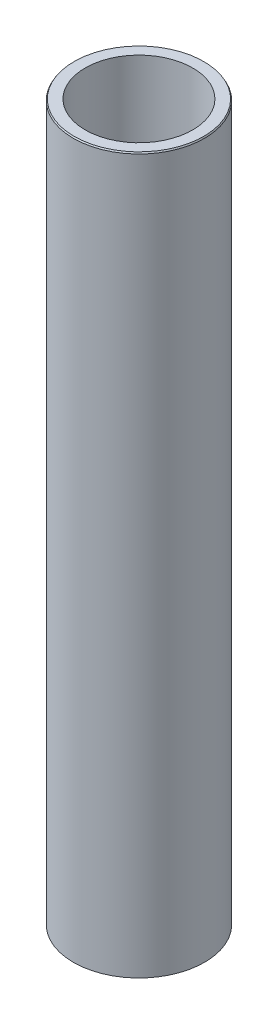
ISO-10303-21;
HEADER;
FILE_DESCRIPTION(('STEP AP214'),'2;1');
FILE_NAME('part.step','',(''),(''),'','','');
FILE_SCHEMA(('AUTOMOTIVE_DESIGN { 1 0 10303 214 1 1 1 1 }'));
ENDSEC;
DATA;
#1=APPLICATION_CONTEXT('core data for automotive mechanical design processes');
#2=APPLICATION_PROTOCOL_DEFINITION('international standard','automotive_design',2000,#1);
#3=PRODUCT_CONTEXT('',#1,'mechanical');
#4=PRODUCT('Part','Part','',(#3));
#5=PRODUCT_RELATED_PRODUCT_CATEGORY('part','',(#4));
#6=PRODUCT_DEFINITION_FORMATION('','',#4);
#7=PRODUCT_DEFINITION_CONTEXT('part definition',#1,'design');
#8=PRODUCT_DEFINITION('design','',#6,#7);
#9=PRODUCT_DEFINITION_SHAPE('','',#8);
#10=(LENGTH_UNIT() NAMED_UNIT(*) SI_UNIT(.MILLI.,.METRE.));
#11=(NAMED_UNIT(*) PLANE_ANGLE_UNIT() SI_UNIT($,.RADIAN.));
#12=(NAMED_UNIT(*) SI_UNIT($,.STERADIAN.) SOLID_ANGLE_UNIT());
#13=UNCERTAINTY_MEASURE_WITH_UNIT(LENGTH_MEASURE(1.E-05),#10,'distance_accuracy_value','');
#14=(GEOMETRIC_REPRESENTATION_CONTEXT(3) GLOBAL_UNCERTAINTY_ASSIGNED_CONTEXT((#13)) GLOBAL_UNIT_ASSIGNED_CONTEXT((#10,
#11,#12)) REPRESENTATION_CONTEXT('',''));
#15=CARTESIAN_POINT('',(0.,0.,0.));
#16=DIRECTION('',(0.,0.,1.));
#17=DIRECTION('',(1.,0.,0.));
#18=AXIS2_PLACEMENT_3D('',#15,#16,#17);
#19=CARTESIAN_POINT('',(0.,600.,0.));
#20=DIRECTION('',(0.,-1.,0.));
#21=DIRECTION('',(0.,0.,-1.));
#22=AXIS2_PLACEMENT_3D('',#19,#20,#21);
#23=CYLINDRICAL_SURFACE('',#22,55.);
#24=CARTESIAN_POINT('',(0.,598.87749162091,0.));
#25=DIRECTION('',(0.,1.,0.));
#26=DIRECTION('',(0.,0.,1.));
#27=AXIS2_PLACEMENT_3D('',#24,#25,#26);
#28=CIRCLE('',#27,55.);
#29=CARTESIAN_POINT('',(0.,598.87749162091,55.));
#30=VERTEX_POINT('',#29);
#31=EDGE_CURVE('E50',#30,#30,#28,.F.);
#32=ORIENTED_EDGE('',*,*,#31,.T.);
#33=EDGE_LOOP('',(#32));
#34=FACE_BOUND('',#33,.T.);
#35=CARTESIAN_POINT('',(0.,0.648080514835336,0.));
#36=DIRECTION('',(0.,1.,0.));
#37=DIRECTION('',(0.,0.,1.));
#38=AXIS2_PLACEMENT_3D('',#35,#36,#37);
#39=CIRCLE('',#38,55.);
#40=CARTESIAN_POINT('',(0.,0.648080514835336,55.));
#41=VERTEX_POINT('',#40);
#42=EDGE_CURVE('E51',#41,#41,#39,.T.);
#43=ORIENTED_EDGE('',*,*,#42,.T.);
#44=EDGE_LOOP('',(#43));
#45=FACE_BOUND('',#44,.T.);
#46=ADVANCED_FACE('F39',(#34,#45),#23,.T.);
#47=CARTESIAN_POINT('',(0.,600.,0.));
#48=DIRECTION('',(0.,1.,0.));
#49=DIRECTION('',(0.,0.,1.));
#50=AXIS2_PLACEMENT_3D('',#47,#48,#49);
#51=PLANE('',#50);
#52=CARTESIAN_POINT('',(0.,600.,0.));
#53=DIRECTION('',(0.,1.,0.));
#54=DIRECTION('',(0.,0.,1.));
#55=AXIS2_PLACEMENT_3D('',#52,#53,#54);
#56=CIRCLE('',#55,54.3519194851647);
#57=CARTESIAN_POINT('',(0.,600.,54.3519194851647));
#58=VERTEX_POINT('',#57);
#59=EDGE_CURVE('E54',#58,#58,#56,.T.);
#60=ORIENTED_EDGE('',*,*,#59,.T.);
#61=EDGE_LOOP('',(#60));
#62=FACE_BOUND('',#61,.T.);
#63=CARTESIAN_POINT('',(0.,600.,0.));
#64=DIRECTION('',(0.,1.,0.));
#65=DIRECTION('',(0.,0.,1.));
#66=AXIS2_PLACEMENT_3D('',#63,#64,#65);
#67=CIRCLE('',#66,45.0499585201987);
#68=CARTESIAN_POINT('',(0.,600.,45.0499585201987));
#69=VERTEX_POINT('',#68);
#70=EDGE_CURVE('E58',#69,#69,#67,.T.);
#71=ORIENTED_EDGE('',*,*,#70,.F.);
#72=EDGE_LOOP('',(#71));
#73=FACE_BOUND('',#72,.T.);
#74=ADVANCED_FACE('F69',(#62,#73),#51,.T.);
#75=CARTESIAN_POINT('',(0.,0.,0.));
#76=DIRECTION('',(0.,1.,0.));
#77=DIRECTION('',(0.,0.,1.));
#78=AXIS2_PLACEMENT_3D('',#75,#76,#77);
#79=PLANE('',#78);
#80=CARTESIAN_POINT('',(0.,0.,0.));
#81=DIRECTION('',(0.,1.,0.));
#82=DIRECTION('',(0.,0.,1.));
#83=AXIS2_PLACEMENT_3D('',#80,#81,#82);
#84=CIRCLE('',#83,53.8774916209097);
#85=CARTESIAN_POINT('',(0.,0.,53.8774916209097));
#86=VERTEX_POINT('',#85);
#87=EDGE_CURVE('E10',#86,#86,#84,.F.);
#88=ORIENTED_EDGE('',*,*,#87,.T.);
#89=EDGE_LOOP('',(#88));
#90=FACE_BOUND('',#89,.T.);
#91=CARTESIAN_POINT('',(0.,0.,0.));
#92=DIRECTION('',(0.,1.,0.));
#93=DIRECTION('',(0.,0.,1.));
#94=AXIS2_PLACEMENT_3D('',#91,#92,#93);
#95=CIRCLE('',#94,45.0499585201987);
#96=CARTESIAN_POINT('',(0.,0.,45.0499585201987));
#97=VERTEX_POINT('',#96);
#98=EDGE_CURVE('E63',#97,#97,#95,.T.);
#99=ORIENTED_EDGE('',*,*,#98,.T.);
#100=EDGE_LOOP('',(#99));
#101=FACE_BOUND('',#100,.T.);
#102=ADVANCED_FACE('F75',(#90,#101),#79,.F.);
#103=CARTESIAN_POINT('',(0.,600.,0.));
#104=DIRECTION('',(0.,-1.,0.));
#105=DIRECTION('',(0.,0.,-1.));
#106=AXIS2_PLACEMENT_3D('',#103,#104,#105);
#107=CYLINDRICAL_SURFACE('',#106,45.0499585201987);
#108=ORIENTED_EDGE('',*,*,#70,.T.);
#109=EDGE_LOOP('',(#108));
#110=FACE_BOUND('',#109,.T.);
#111=ORIENTED_EDGE('',*,*,#98,.F.);
#112=EDGE_LOOP('',(#111));
#113=FACE_BOUND('',#112,.T.);
#114=ADVANCED_FACE('F70',(#110,#113),#107,.F.);
#115=CARTESIAN_POINT('',(0.,600.,0.));
#116=DIRECTION('',(0.,-1.,0.));
#117=DIRECTION('',(0.,0.,-1.));
#118=AXIS2_PLACEMENT_3D('',#115,#116,#117);
#119=CONICAL_SURFACE('',#118,54.3519194851647,0.523598775598341);
#120=ORIENTED_EDGE('',*,*,#31,.F.);
#121=EDGE_LOOP('',(#120));
#122=FACE_BOUND('',#121,.T.);
#123=ORIENTED_EDGE('',*,*,#59,.F.);
#124=EDGE_LOOP('',(#123));
#125=FACE_BOUND('',#124,.T.);
#126=ADVANCED_FACE('F81',(#122,#125),#119,.T.);
#127=CARTESIAN_POINT('',(0.,0.648080514835336,0.));
#128=DIRECTION('',(0.,1.,0.));
#129=DIRECTION('',(0.,0.,1.));
#130=AXIS2_PLACEMENT_3D('',#127,#128,#129);
#131=CONICAL_SURFACE('',#130,55.,1.04719755119664);
#132=ORIENTED_EDGE('',*,*,#87,.F.);
#133=EDGE_LOOP('',(#132));
#134=FACE_BOUND('',#133,.T.);
#135=ORIENTED_EDGE('',*,*,#42,.F.);
#136=EDGE_LOOP('',(#135));
#137=FACE_BOUND('',#136,.T.);
#138=ADVANCED_FACE('F45',(#134,#137),#131,.T.);
#139=CLOSED_SHELL('',(#46,#74,#102,#114,#126,#138));
#140=MANIFOLD_SOLID_BREP('B2',#139);
#141=ADVANCED_BREP_SHAPE_REPRESENTATION('',(#18,#140),#14);
#142=SHAPE_DEFINITION_REPRESENTATION(#9,#141);
ENDSEC;
END-ISO-10303-21;
